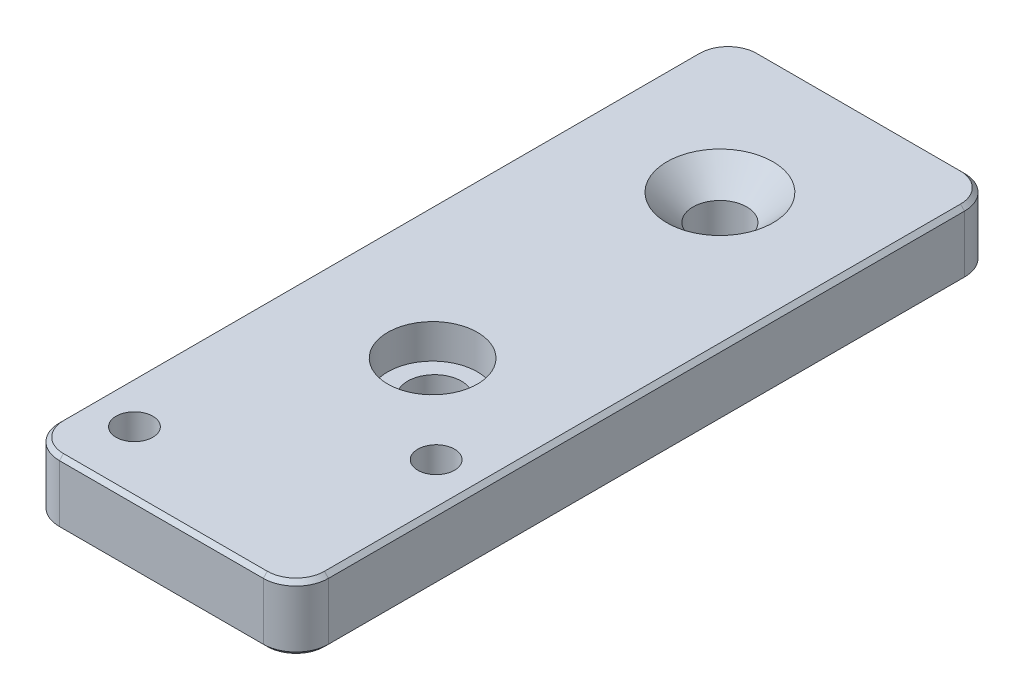
ISO-10303-21;
HEADER;
FILE_DESCRIPTION(('STEP AP214'),'2;1');
FILE_NAME('part.step','',(''),(''),'','','');
FILE_SCHEMA(('AUTOMOTIVE_DESIGN { 1 0 10303 214 1 1 1 1 }'));
ENDSEC;
DATA;
#1=APPLICATION_CONTEXT('core data for automotive mechanical design processes');
#2=APPLICATION_PROTOCOL_DEFINITION('international standard','automotive_design',2000,#1);
#3=PRODUCT_CONTEXT('',#1,'mechanical');
#4=PRODUCT('Part','Part','',(#3));
#5=PRODUCT_RELATED_PRODUCT_CATEGORY('part','',(#4));
#6=PRODUCT_DEFINITION_FORMATION('','',#4);
#7=PRODUCT_DEFINITION_CONTEXT('part definition',#1,'design');
#8=PRODUCT_DEFINITION('design','',#6,#7);
#9=PRODUCT_DEFINITION_SHAPE('','',#8);
#10=(LENGTH_UNIT() NAMED_UNIT(*) SI_UNIT(.MILLI.,.METRE.));
#11=(NAMED_UNIT(*) PLANE_ANGLE_UNIT() SI_UNIT($,.RADIAN.));
#12=(NAMED_UNIT(*) SI_UNIT($,.STERADIAN.) SOLID_ANGLE_UNIT());
#13=UNCERTAINTY_MEASURE_WITH_UNIT(LENGTH_MEASURE(1.E-05),#10,'distance_accuracy_value','');
#14=(GEOMETRIC_REPRESENTATION_CONTEXT(3) GLOBAL_UNCERTAINTY_ASSIGNED_CONTEXT((#13)) GLOBAL_UNIT_ASSIGNED_CONTEXT((#10,
#11,#12)) REPRESENTATION_CONTEXT('',''));
#15=CARTESIAN_POINT('',(0.,0.,0.));
#16=DIRECTION('',(0.,0.,1.));
#17=DIRECTION('',(1.,0.,0.));
#18=AXIS2_PLACEMENT_3D('',#15,#16,#17);
#19=CARTESIAN_POINT('',(11.,8.,20.3));
#20=DIRECTION('',(0.,-1.,0.));
#21=DIRECTION('',(0.,0.,-1.));
#22=AXIS2_PLACEMENT_3D('',#19,#20,#21);
#23=CYLINDRICAL_SURFACE('',#22,2.25);
#24=CARTESIAN_POINT('',(11.,8.,20.3));
#25=DIRECTION('',(0.,1.,0.));
#26=DIRECTION('',(0.,0.,1.));
#27=AXIS2_PLACEMENT_3D('',#24,#25,#26);
#28=CIRCLE('',#27,2.25);
#29=CARTESIAN_POINT('',(11.,8.,22.55));
#30=VERTEX_POINT('',#29);
#31=EDGE_CURVE('E803',#30,#30,#28,.T.);
#32=ORIENTED_EDGE('',*,*,#31,.T.);
#33=EDGE_LOOP('',(#32));
#34=FACE_BOUND('',#33,.T.);
#35=CARTESIAN_POINT('',(11.,4.4,20.3));
#36=DIRECTION('',(0.,-1.,0.));
#37=DIRECTION('',(0.,0.,-1.));
#38=AXIS2_PLACEMENT_3D('',#35,#36,#37);
#39=CIRCLE('',#38,2.25);
#40=CARTESIAN_POINT('',(11.,4.4,18.05));
#41=VERTEX_POINT('',#40);
#42=EDGE_CURVE('E789',#41,#41,#39,.T.);
#43=ORIENTED_EDGE('',*,*,#42,.T.);
#44=EDGE_LOOP('',(#43));
#45=FACE_BOUND('',#44,.T.);
#46=ADVANCED_FACE('F41',(#34,#45),#23,.F.);
#47=CARTESIAN_POINT('',(-11.,8.,35.3));
#48=DIRECTION('',(0.,-1.,0.));
#49=DIRECTION('',(0.,0.,-1.));
#50=AXIS2_PLACEMENT_3D('',#47,#48,#49);
#51=CYLINDRICAL_SURFACE('',#50,2.25);
#52=CARTESIAN_POINT('',(-11.,8.,35.3));
#53=DIRECTION('',(0.,1.,0.));
#54=DIRECTION('',(0.,0.,1.));
#55=AXIS2_PLACEMENT_3D('',#52,#53,#54);
#56=CIRCLE('',#55,2.25);
#57=CARTESIAN_POINT('',(-11.,8.,37.55));
#58=VERTEX_POINT('',#57);
#59=EDGE_CURVE('E799',#58,#58,#56,.T.);
#60=ORIENTED_EDGE('',*,*,#59,.T.);
#61=EDGE_LOOP('',(#60));
#62=FACE_BOUND('',#61,.T.);
#63=CARTESIAN_POINT('',(-11.,4.4,35.3));
#64=DIRECTION('',(0.,-1.,0.));
#65=DIRECTION('',(0.,0.,-1.));
#66=AXIS2_PLACEMENT_3D('',#63,#64,#65);
#67=CIRCLE('',#66,2.25);
#68=CARTESIAN_POINT('',(-11.,4.4,33.05));
#69=VERTEX_POINT('',#68);
#70=EDGE_CURVE('E796',#69,#69,#67,.T.);
#71=ORIENTED_EDGE('',*,*,#70,.T.);
#72=EDGE_LOOP('',(#71));
#73=FACE_BOUND('',#72,.T.);
#74=ADVANCED_FACE('F441',(#62,#73),#51,.F.);
#75=CARTESIAN_POINT('',(0.,8.,9.50000000000003));
#76=DIRECTION('',(0.,-1.,0.));
#77=DIRECTION('',(0.,0.,-1.));
#78=AXIS2_PLACEMENT_3D('',#75,#76,#77);
#79=CYLINDRICAL_SURFACE('',#78,3.3);
#80=CARTESIAN_POINT('',(0.,0.,9.50000000000003));
#81=DIRECTION('',(0.,1.,0.));
#82=DIRECTION('',(0.,0.,1.));
#83=AXIS2_PLACEMENT_3D('',#80,#81,#82);
#84=CIRCLE('',#83,3.3);
#85=CARTESIAN_POINT('',(0.,0.,12.8));
#86=VERTEX_POINT('',#85);
#87=EDGE_CURVE('E806',#86,#86,#84,.T.);
#88=ORIENTED_EDGE('',*,*,#87,.F.);
#89=EDGE_LOOP('',(#88));
#90=FACE_BOUND('',#89,.T.);
#91=CARTESIAN_POINT('',(0.,3.8,9.50000000000003));
#92=DIRECTION('',(0.,1.,0.));
#93=DIRECTION('',(0.,0.,1.));
#94=AXIS2_PLACEMENT_3D('',#91,#92,#93);
#95=CIRCLE('',#94,3.3);
#96=CARTESIAN_POINT('',(0.,3.8,12.8));
#97=VERTEX_POINT('',#96);
#98=EDGE_CURVE('E793',#97,#97,#95,.T.);
#99=ORIENTED_EDGE('',*,*,#98,.T.);
#100=EDGE_LOOP('',(#99));
#101=FACE_BOUND('',#100,.T.);
#102=ADVANCED_FACE('F447',(#90,#101),#79,.F.);
#103=CARTESIAN_POINT('',(0.,8.,0.));
#104=DIRECTION('',(0.,-1.,0.));
#105=DIRECTION('',(0.,0.,-1.));
#106=AXIS2_PLACEMENT_3D('',#103,#104,#105);
#107=PLANE('',#106);
#108=CARTESIAN_POINT('',(-12.5,8.,-39.));
#109=DIRECTION('',(0.,-1.,0.));
#110=DIRECTION('',(0.,0.,-1.));
#111=AXIS2_PLACEMENT_3D('',#108,#109,#110);
#112=CIRCLE('',#111,3.5);
#113=CARTESIAN_POINT('',(-12.5,8.,-42.5));
#114=VERTEX_POINT('',#113);
#115=CARTESIAN_POINT('',(-16.,8.,-39.));
#116=VERTEX_POINT('',#115);
#117=EDGE_CURVE('E377',#114,#116,#112,.F.);
#118=ORIENTED_EDGE('',*,*,#117,.T.);
#119=DIRECTION('',(0.,0.,1.));
#120=VECTOR('',#119,1.);
#121=CARTESIAN_POINT('',(-16.,8.,0.));
#122=LINE('',#121,#120);
#123=CARTESIAN_POINT('',(-16.,8.,39.));
#124=VERTEX_POINT('',#123);
#125=EDGE_CURVE('E380',#116,#124,#122,.T.);
#126=ORIENTED_EDGE('',*,*,#125,.T.);
#127=CARTESIAN_POINT('',(-12.5,8.,39.));
#128=DIRECTION('',(0.,-1.,0.));
#129=DIRECTION('',(0.,0.,-1.));
#130=AXIS2_PLACEMENT_3D('',#127,#128,#129);
#131=CIRCLE('',#130,3.5);
#132=CARTESIAN_POINT('',(-12.5,8.,42.5));
#133=VERTEX_POINT('',#132);
#134=EDGE_CURVE('E163',#124,#133,#131,.F.);
#135=ORIENTED_EDGE('',*,*,#134,.T.);
#136=DIRECTION('',(1.,0.,0.));
#137=VECTOR('',#136,1.);
#138=CARTESIAN_POINT('',(0.,8.,42.5));
#139=LINE('',#138,#137);
#140=CARTESIAN_POINT('',(12.5,8.,42.5));
#141=VERTEX_POINT('',#140);
#142=EDGE_CURVE('E155',#133,#141,#139,.T.);
#143=ORIENTED_EDGE('',*,*,#142,.T.);
#144=CARTESIAN_POINT('',(12.5,8.,39.));
#145=DIRECTION('',(0.,-1.,0.));
#146=DIRECTION('',(0.,0.,-1.));
#147=AXIS2_PLACEMENT_3D('',#144,#145,#146);
#148=CIRCLE('',#147,3.5);
#149=CARTESIAN_POINT('',(16.,8.,39.));
#150=VERTEX_POINT('',#149);
#151=EDGE_CURVE('E159',#141,#150,#148,.F.);
#152=ORIENTED_EDGE('',*,*,#151,.T.);
#153=DIRECTION('',(0.,0.,-1.));
#154=VECTOR('',#153,1.);
#155=CARTESIAN_POINT('',(16.,8.,0.));
#156=LINE('',#155,#154);
#157=CARTESIAN_POINT('',(16.,8.,-39.));
#158=VERTEX_POINT('',#157);
#159=EDGE_CURVE('E368',#150,#158,#156,.T.);
#160=ORIENTED_EDGE('',*,*,#159,.T.);
#161=CARTESIAN_POINT('',(12.5,8.,-39.));
#162=DIRECTION('',(0.,-1.,0.));
#163=DIRECTION('',(0.,0.,-1.));
#164=AXIS2_PLACEMENT_3D('',#161,#162,#163);
#165=CIRCLE('',#164,3.5);
#166=CARTESIAN_POINT('',(12.5,8.,-42.5));
#167=VERTEX_POINT('',#166);
#168=EDGE_CURVE('E371',#158,#167,#165,.F.);
#169=ORIENTED_EDGE('',*,*,#168,.T.);
#170=DIRECTION('',(-1.,0.,0.));
#171=VECTOR('',#170,1.);
#172=CARTESIAN_POINT('',(0.,8.,-42.5));
#173=LINE('',#172,#171);
#174=EDGE_CURVE('E374',#167,#114,#173,.T.);
#175=ORIENTED_EDGE('',*,*,#174,.T.);
#176=EDGE_LOOP('',(#118,#126,#135,#143,#152,#160,#169,#175));
#177=FACE_BOUND('',#176,.T.);
#178=CARTESIAN_POINT('',(0.,8.,-25.5));
#179=DIRECTION('',(0.,-1.,0.));
#180=DIRECTION('',(0.,0.,-1.));
#181=AXIS2_PLACEMENT_3D('',#178,#179,#180);
#182=CIRCLE('',#181,6.49999999999999);
#183=CARTESIAN_POINT('',(0.,8.,-32.));
#184=VERTEX_POINT('',#183);
#185=EDGE_CURVE('E346',#184,#184,#182,.T.);
#186=ORIENTED_EDGE('',*,*,#185,.T.);
#187=EDGE_LOOP('',(#186));
#188=FACE_BOUND('',#187,.T.);
#189=CARTESIAN_POINT('',(0.,8.,9.73630831643001));
#190=DIRECTION('',(0.,1.,0.));
#191=DIRECTION('',(0.,0.,1.));
#192=AXIS2_PLACEMENT_3D('',#189,#190,#191);
#193=CIRCLE('',#192,5.5);
#194=CARTESIAN_POINT('',(0.,8.,15.23630831643));
#195=VERTEX_POINT('',#194);
#196=EDGE_CURVE('E786',#195,#195,#193,.T.);
#197=ORIENTED_EDGE('',*,*,#196,.F.);
#198=EDGE_LOOP('',(#197));
#199=FACE_BOUND('',#198,.T.);
#200=ORIENTED_EDGE('',*,*,#31,.F.);
#201=EDGE_LOOP('',(#200));
#202=FACE_BOUND('',#201,.T.);
#203=ORIENTED_EDGE('',*,*,#59,.F.);
#204=EDGE_LOOP('',(#203));
#205=FACE_BOUND('',#204,.T.);
#206=ADVANCED_FACE('F157',(#177,#188,#199,#202,#205),#107,.F.);
#207=CARTESIAN_POINT('',(0.,0.,0.));
#208=DIRECTION('',(0.,-1.,0.));
#209=DIRECTION('',(0.,0.,-1.));
#210=AXIS2_PLACEMENT_3D('',#207,#208,#209);
#211=PLANE('',#210);
#212=CARTESIAN_POINT('',(12.5,0.,-39.));
#213=DIRECTION('',(0.,-1.,0.));
#214=DIRECTION('',(0.,0.,-1.));
#215=AXIS2_PLACEMENT_3D('',#212,#213,#214);
#216=CIRCLE('',#215,3.5);
#217=CARTESIAN_POINT('',(12.5,0.,-42.5));
#218=VERTEX_POINT('',#217);
#219=CARTESIAN_POINT('',(16.,0.,-39.));
#220=VERTEX_POINT('',#219);
#221=EDGE_CURVE('E52',#218,#220,#216,.T.);
#222=ORIENTED_EDGE('',*,*,#221,.T.);
#223=DIRECTION('',(0.,0.,1.));
#224=VECTOR('',#223,1.);
#225=CARTESIAN_POINT('',(16.,0.,39.));
#226=LINE('',#225,#224);
#227=CARTESIAN_POINT('',(16.,0.,39.));
#228=VERTEX_POINT('',#227);
#229=EDGE_CURVE('E11',#220,#228,#226,.T.);
#230=ORIENTED_EDGE('',*,*,#229,.T.);
#231=CARTESIAN_POINT('',(12.5,0.,39.));
#232=DIRECTION('',(0.,-1.,0.));
#233=DIRECTION('',(0.,0.,-1.));
#234=AXIS2_PLACEMENT_3D('',#231,#232,#233);
#235=CIRCLE('',#234,3.5);
#236=CARTESIAN_POINT('',(12.5,0.,42.5));
#237=VERTEX_POINT('',#236);
#238=EDGE_CURVE('E283',#228,#237,#235,.T.);
#239=ORIENTED_EDGE('',*,*,#238,.T.);
#240=DIRECTION('',(-1.,0.,0.));
#241=VECTOR('',#240,1.);
#242=CARTESIAN_POINT('',(-12.5,0.,42.5));
#243=LINE('',#242,#241);
#244=CARTESIAN_POINT('',(-12.5,0.,42.5));
#245=VERTEX_POINT('',#244);
#246=EDGE_CURVE('E277',#237,#245,#243,.T.);
#247=ORIENTED_EDGE('',*,*,#246,.T.);
#248=CARTESIAN_POINT('',(-12.5,0.,39.));
#249=DIRECTION('',(0.,-1.,0.));
#250=DIRECTION('',(0.,0.,-1.));
#251=AXIS2_PLACEMENT_3D('',#248,#249,#250);
#252=CIRCLE('',#251,3.5);
#253=CARTESIAN_POINT('',(-16.,0.,39.));
#254=VERTEX_POINT('',#253);
#255=EDGE_CURVE('E280',#245,#254,#252,.T.);
#256=ORIENTED_EDGE('',*,*,#255,.T.);
#257=DIRECTION('',(0.,0.,-1.));
#258=VECTOR('',#257,1.);
#259=CARTESIAN_POINT('',(-16.,0.,-39.));
#260=LINE('',#259,#258);
#261=CARTESIAN_POINT('',(-16.,0.,-39.));
#262=VERTEX_POINT('',#261);
#263=EDGE_CURVE('E286',#254,#262,#260,.T.);
#264=ORIENTED_EDGE('',*,*,#263,.T.);
#265=CARTESIAN_POINT('',(-12.5,0.,-39.));
#266=DIRECTION('',(0.,-1.,0.));
#267=DIRECTION('',(0.,0.,-1.));
#268=AXIS2_PLACEMENT_3D('',#265,#266,#267);
#269=CIRCLE('',#268,3.5);
#270=CARTESIAN_POINT('',(-12.5,0.,-42.5));
#271=VERTEX_POINT('',#270);
#272=EDGE_CURVE('E289',#262,#271,#269,.T.);
#273=ORIENTED_EDGE('',*,*,#272,.T.);
#274=DIRECTION('',(1.,0.,0.));
#275=VECTOR('',#274,1.);
#276=CARTESIAN_POINT('',(12.5,0.,-42.5));
#277=LINE('',#276,#275);
#278=EDGE_CURVE('E63',#271,#218,#277,.T.);
#279=ORIENTED_EDGE('',*,*,#278,.T.);
#280=EDGE_LOOP('',(#222,#230,#239,#247,#256,#264,#273,#279));
#281=FACE_BOUND('',#280,.T.);
#282=CARTESIAN_POINT('',(-11.,0.,35.3));
#283=DIRECTION('',(0.,-1.,0.));
#284=DIRECTION('',(0.,0.,-1.));
#285=AXIS2_PLACEMENT_3D('',#282,#283,#284);
#286=CIRCLE('',#285,4.);
#287=CARTESIAN_POINT('',(-11.,0.,31.3));
#288=VERTEX_POINT('',#287);
#289=EDGE_CURVE('E831',#288,#288,#286,.T.);
#290=ORIENTED_EDGE('',*,*,#289,.F.);
#291=EDGE_LOOP('',(#290));
#292=FACE_BOUND('',#291,.T.);
#293=CARTESIAN_POINT('',(11.,0.,20.3));
#294=DIRECTION('',(0.,-1.,0.));
#295=DIRECTION('',(0.,0.,-1.));
#296=AXIS2_PLACEMENT_3D('',#293,#294,#295);
#297=CIRCLE('',#296,4.);
#298=CARTESIAN_POINT('',(11.,0.,16.3));
#299=VERTEX_POINT('',#298);
#300=EDGE_CURVE('E203',#299,#299,#297,.T.);
#301=ORIENTED_EDGE('',*,*,#300,.F.);
#302=EDGE_LOOP('',(#301));
#303=FACE_BOUND('',#302,.T.);
#304=CARTESIAN_POINT('',(0.,0.,-25.5));
#305=DIRECTION('',(0.,1.,0.));
#306=DIRECTION('',(0.,0.,1.));
#307=AXIS2_PLACEMENT_3D('',#304,#305,#306);
#308=CIRCLE('',#307,3.3);
#309=CARTESIAN_POINT('',(0.,0.,-22.2));
#310=VERTEX_POINT('',#309);
#311=EDGE_CURVE('E810',#310,#310,#308,.T.);
#312=ORIENTED_EDGE('',*,*,#311,.T.);
#313=EDGE_LOOP('',(#312));
#314=FACE_BOUND('',#313,.T.);
#315=ORIENTED_EDGE('',*,*,#87,.T.);
#316=EDGE_LOOP('',(#315));
#317=FACE_BOUND('',#316,.T.);
#318=ADVANCED_FACE('F295',(#281,#292,#303,#314,#317),#211,.T.);
#319=CARTESIAN_POINT('',(16.5,8.,43.));
#320=DIRECTION('',(-1.,0.,0.));
#321=DIRECTION('',(0.,0.,1.));
#322=AXIS2_PLACEMENT_3D('',#319,#320,#321);
#323=PLANE('',#322);
#324=DIRECTION('',(0.,-1.,0.));
#325=VECTOR('',#324,1.);
#326=CARTESIAN_POINT('',(16.5,8.,-39.));
#327=LINE('',#326,#325);
#328=CARTESIAN_POINT('',(16.5,0.5,-39.));
#329=VERTEX_POINT('',#328);
#330=CARTESIAN_POINT('',(16.5,7.5,-39.));
#331=VERTEX_POINT('',#330);
#332=EDGE_CURVE('E340',#329,#331,#327,.F.);
#333=ORIENTED_EDGE('',*,*,#332,.T.);
#334=DIRECTION('',(0.,0.,1.));
#335=VECTOR('',#334,1.);
#336=CARTESIAN_POINT('',(16.5,7.5,43.));
#337=LINE('',#336,#335);
#338=CARTESIAN_POINT('',(16.5,7.5,39.));
#339=VERTEX_POINT('',#338);
#340=EDGE_CURVE('E265',#331,#339,#337,.T.);
#341=ORIENTED_EDGE('',*,*,#340,.T.);
#342=DIRECTION('',(0.,-1.,0.));
#343=VECTOR('',#342,1.);
#344=CARTESIAN_POINT('',(16.5,8.,39.));
#345=LINE('',#344,#343);
#346=CARTESIAN_POINT('',(16.5,0.5,39.));
#347=VERTEX_POINT('',#346);
#348=EDGE_CURVE('E330',#339,#347,#345,.T.);
#349=ORIENTED_EDGE('',*,*,#348,.T.);
#350=DIRECTION('',(0.,0.,-1.));
#351=VECTOR('',#350,1.);
#352=CARTESIAN_POINT('',(16.5,0.5,-39.));
#353=LINE('',#352,#351);
#354=EDGE_CURVE('E313',#347,#329,#353,.T.);
#355=ORIENTED_EDGE('',*,*,#354,.T.);
#356=EDGE_LOOP('',(#333,#341,#349,#355));
#357=FACE_BOUND('',#356,.T.);
#358=ADVANCED_FACE('F335',(#357),#323,.F.);
#359=CARTESIAN_POINT('',(-16.5,8.,-43.));
#360=DIRECTION('',(0.,0.,1.));
#361=DIRECTION('',(1.,0.,0.));
#362=AXIS2_PLACEMENT_3D('',#359,#360,#361);
#363=PLANE('',#362);
#364=DIRECTION('',(0.,-1.,0.));
#365=VECTOR('',#364,1.);
#366=CARTESIAN_POINT('',(-12.5,8.,-43.));
#367=LINE('',#366,#365);
#368=CARTESIAN_POINT('',(-12.5,0.5,-43.));
#369=VERTEX_POINT('',#368);
#370=CARTESIAN_POINT('',(-12.5,7.5,-43.));
#371=VERTEX_POINT('',#370);
#372=EDGE_CURVE('E180',#369,#371,#367,.F.);
#373=ORIENTED_EDGE('',*,*,#372,.T.);
#374=DIRECTION('',(1.,0.,0.));
#375=VECTOR('',#374,1.);
#376=CARTESIAN_POINT('',(-16.5,7.5,-43.));
#377=LINE('',#376,#375);
#378=CARTESIAN_POINT('',(12.5,7.5,-43.));
#379=VERTEX_POINT('',#378);
#380=EDGE_CURVE('E397',#371,#379,#377,.T.);
#381=ORIENTED_EDGE('',*,*,#380,.T.);
#382=DIRECTION('',(0.,-1.,0.));
#383=VECTOR('',#382,1.);
#384=CARTESIAN_POINT('',(12.5,8.,-43.));
#385=LINE('',#384,#383);
#386=CARTESIAN_POINT('',(12.5,0.5,-43.));
#387=VERTEX_POINT('',#386);
#388=EDGE_CURVE('E359',#379,#387,#385,.T.);
#389=ORIENTED_EDGE('',*,*,#388,.T.);
#390=DIRECTION('',(-1.,0.,0.));
#391=VECTOR('',#390,1.);
#392=CARTESIAN_POINT('',(-12.5,0.5,-43.));
#393=LINE('',#392,#391);
#394=EDGE_CURVE('E303',#387,#369,#393,.T.);
#395=ORIENTED_EDGE('',*,*,#394,.T.);
#396=EDGE_LOOP('',(#373,#381,#389,#395));
#397=FACE_BOUND('',#396,.T.);
#398=ADVANCED_FACE('F473',(#397),#363,.F.);
#399=CARTESIAN_POINT('',(-16.5,8.,43.));
#400=DIRECTION('',(1.,0.,0.));
#401=DIRECTION('',(0.,0.,-1.));
#402=AXIS2_PLACEMENT_3D('',#399,#400,#401);
#403=PLANE('',#402);
#404=DIRECTION('',(0.,-1.,0.));
#405=VECTOR('',#404,1.);
#406=CARTESIAN_POINT('',(-16.5,8.,39.));
#407=LINE('',#406,#405);
#408=CARTESIAN_POINT('',(-16.5,0.5,39.));
#409=VERTEX_POINT('',#408);
#410=CARTESIAN_POINT('',(-16.5,7.5,39.));
#411=VERTEX_POINT('',#410);
#412=EDGE_CURVE('E356',#409,#411,#407,.F.);
#413=ORIENTED_EDGE('',*,*,#412,.T.);
#414=DIRECTION('',(0.,0.,-1.));
#415=VECTOR('',#414,1.);
#416=CARTESIAN_POINT('',(-16.5,7.5,43.));
#417=LINE('',#416,#415);
#418=CARTESIAN_POINT('',(-16.5,7.5,-39.));
#419=VERTEX_POINT('',#418);
#420=EDGE_CURVE('E386',#411,#419,#417,.T.);
#421=ORIENTED_EDGE('',*,*,#420,.T.);
#422=DIRECTION('',(0.,-1.,0.));
#423=VECTOR('',#422,1.);
#424=CARTESIAN_POINT('',(-16.5,8.,-39.));
#425=LINE('',#424,#423);
#426=CARTESIAN_POINT('',(-16.5,0.5,-39.));
#427=VERTEX_POINT('',#426);
#428=EDGE_CURVE('E352',#419,#427,#425,.T.);
#429=ORIENTED_EDGE('',*,*,#428,.T.);
#430=DIRECTION('',(0.,0.,1.));
#431=VECTOR('',#430,1.);
#432=CARTESIAN_POINT('',(-16.5,0.5,39.));
#433=LINE('',#432,#431);
#434=EDGE_CURVE('E383',#427,#409,#433,.T.);
#435=ORIENTED_EDGE('',*,*,#434,.T.);
#436=EDGE_LOOP('',(#413,#421,#429,#435));
#437=FACE_BOUND('',#436,.T.);
#438=ADVANCED_FACE('F469',(#437),#403,.F.);
#439=CARTESIAN_POINT('',(-16.5,8.,43.));
#440=DIRECTION('',(0.,0.,-1.));
#441=DIRECTION('',(-1.,0.,0.));
#442=AXIS2_PLACEMENT_3D('',#439,#440,#441);
#443=PLANE('',#442);
#444=DIRECTION('',(0.,-1.,0.));
#445=VECTOR('',#444,1.);
#446=CARTESIAN_POINT('',(12.5,8.,43.));
#447=LINE('',#446,#445);
#448=CARTESIAN_POINT('',(12.5,0.5,43.));
#449=VERTEX_POINT('',#448);
#450=CARTESIAN_POINT('',(12.5,7.5,43.));
#451=VERTEX_POINT('',#450);
#452=EDGE_CURVE('E332',#449,#451,#447,.F.);
#453=ORIENTED_EDGE('',*,*,#452,.T.);
#454=DIRECTION('',(-1.,0.,0.));
#455=VECTOR('',#454,1.);
#456=CARTESIAN_POINT('',(-16.5,7.5,43.));
#457=LINE('',#456,#455);
#458=CARTESIAN_POINT('',(-12.5,7.5,43.));
#459=VERTEX_POINT('',#458);
#460=EDGE_CURVE('E183',#451,#459,#457,.T.);
#461=ORIENTED_EDGE('',*,*,#460,.T.);
#462=DIRECTION('',(0.,-1.,0.));
#463=VECTOR('',#462,1.);
#464=CARTESIAN_POINT('',(-12.5,8.,43.));
#465=LINE('',#464,#463);
#466=CARTESIAN_POINT('',(-12.5,0.5,43.));
#467=VERTEX_POINT('',#466);
#468=EDGE_CURVE('E339',#459,#467,#465,.T.);
#469=ORIENTED_EDGE('',*,*,#468,.T.);
#470=DIRECTION('',(1.,0.,0.));
#471=VECTOR('',#470,1.);
#472=CARTESIAN_POINT('',(12.5,0.5,43.));
#473=LINE('',#472,#471);
#474=EDGE_CURVE('E259',#467,#449,#473,.T.);
#475=ORIENTED_EDGE('',*,*,#474,.T.);
#476=EDGE_LOOP('',(#453,#461,#469,#475));
#477=FACE_BOUND('',#476,.T.);
#478=ADVANCED_FACE('F461',(#477),#443,.F.);
#479=CARTESIAN_POINT('',(0.,8.,-25.5));
#480=DIRECTION('',(0.,-1.,0.));
#481=DIRECTION('',(0.,0.,-1.));
#482=AXIS2_PLACEMENT_3D('',#479,#480,#481);
#483=CYLINDRICAL_SURFACE('',#482,3.3);
#484=CARTESIAN_POINT('',(0.,4.80000000000003,-25.5));
#485=DIRECTION('',(0.,-1.,0.));
#486=DIRECTION('',(0.,0.,-1.));
#487=AXIS2_PLACEMENT_3D('',#484,#485,#486);
#488=CIRCLE('',#487,3.3);
#489=CARTESIAN_POINT('',(0.,4.80000000000003,-28.8));
#490=VERTEX_POINT('',#489);
#491=EDGE_CURVE('E814',#490,#490,#488,.F.);
#492=ORIENTED_EDGE('',*,*,#491,.T.);
#493=EDGE_LOOP('',(#492));
#494=FACE_BOUND('',#493,.T.);
#495=ORIENTED_EDGE('',*,*,#311,.F.);
#496=EDGE_LOOP('',(#495));
#497=FACE_BOUND('',#496,.T.);
#498=ADVANCED_FACE('F457',(#494,#497),#483,.F.);
#499=CARTESIAN_POINT('',(0.,3.8,9.73630831643001));
#500=DIRECTION('',(0.,1.,0.));
#501=DIRECTION('',(0.,0.,1.));
#502=AXIS2_PLACEMENT_3D('',#499,#500,#501);
#503=CYLINDRICAL_SURFACE('',#502,5.5);
#504=CARTESIAN_POINT('',(0.,3.8,9.73630831643001));
#505=DIRECTION('',(0.,1.,0.));
#506=DIRECTION('',(0.,0.,1.));
#507=AXIS2_PLACEMENT_3D('',#504,#505,#506);
#508=CIRCLE('',#507,5.5);
#509=CARTESIAN_POINT('',(0.,3.8,15.23630831643));
#510=VERTEX_POINT('',#509);
#511=EDGE_CURVE('E783',#510,#510,#508,.T.);
#512=ORIENTED_EDGE('',*,*,#511,.F.);
#513=EDGE_LOOP('',(#512));
#514=FACE_BOUND('',#513,.T.);
#515=ORIENTED_EDGE('',*,*,#196,.T.);
#516=EDGE_LOOP('',(#515));
#517=FACE_BOUND('',#516,.T.);
#518=ADVANCED_FACE('F460',(#514,#517),#503,.F.);
#519=CARTESIAN_POINT('',(0.,3.8,9.73630831643001));
#520=DIRECTION('',(0.,1.,0.));
#521=DIRECTION('',(0.,0.,1.));
#522=AXIS2_PLACEMENT_3D('',#519,#520,#521);
#523=PLANE('',#522);
#524=ORIENTED_EDGE('',*,*,#98,.F.);
#525=EDGE_LOOP('',(#524));
#526=FACE_BOUND('',#525,.T.);
#527=ORIENTED_EDGE('',*,*,#511,.T.);
#528=EDGE_LOOP('',(#527));
#529=FACE_BOUND('',#528,.T.);
#530=ADVANCED_FACE('F488',(#526,#529),#523,.T.);
#531=CARTESIAN_POINT('',(0.,4.80000000000003,-25.5));
#532=DIRECTION('',(0.,1.,0.));
#533=DIRECTION('',(0.,0.,1.));
#534=AXIS2_PLACEMENT_3D('',#531,#532,#533);
#535=CONICAL_SURFACE('',#534,3.3,0.785398163397451);
#536=ORIENTED_EDGE('',*,*,#185,.F.);
#537=EDGE_LOOP('',(#536));
#538=FACE_BOUND('',#537,.T.);
#539=ORIENTED_EDGE('',*,*,#491,.F.);
#540=EDGE_LOOP('',(#539));
#541=FACE_BOUND('',#540,.T.);
#542=ADVANCED_FACE('F481',(#538,#541),#535,.F.);
#543=CARTESIAN_POINT('',(-11.,4.4,35.3));
#544=DIRECTION('',(0.,-1.,0.));
#545=DIRECTION('',(0.,0.,-1.));
#546=AXIS2_PLACEMENT_3D('',#543,#544,#545);
#547=CYLINDRICAL_SURFACE('',#546,4.);
#548=CARTESIAN_POINT('',(-11.,4.4,35.3));
#549=DIRECTION('',(0.,-1.,0.));
#550=DIRECTION('',(0.,0.,-1.));
#551=AXIS2_PLACEMENT_3D('',#548,#549,#550);
#552=CIRCLE('',#551,4.);
#553=CARTESIAN_POINT('',(-11.,4.4,31.3));
#554=VERTEX_POINT('',#553);
#555=EDGE_CURVE('E826',#554,#554,#552,.T.);
#556=ORIENTED_EDGE('',*,*,#555,.F.);
#557=EDGE_LOOP('',(#556));
#558=FACE_BOUND('',#557,.T.);
#559=ORIENTED_EDGE('',*,*,#289,.T.);
#560=EDGE_LOOP('',(#559));
#561=FACE_BOUND('',#560,.T.);
#562=ADVANCED_FACE('F487',(#558,#561),#547,.F.);
#563=CARTESIAN_POINT('',(-11.,4.4,35.3));
#564=DIRECTION('',(0.,-1.,0.));
#565=DIRECTION('',(0.,0.,-1.));
#566=AXIS2_PLACEMENT_3D('',#563,#564,#565);
#567=PLANE('',#566);
#568=ORIENTED_EDGE('',*,*,#70,.F.);
#569=EDGE_LOOP('',(#568));
#570=FACE_BOUND('',#569,.T.);
#571=ORIENTED_EDGE('',*,*,#555,.T.);
#572=EDGE_LOOP('',(#571));
#573=FACE_BOUND('',#572,.T.);
#574=ADVANCED_FACE('F675',(#570,#573),#567,.T.);
#575=CARTESIAN_POINT('',(11.,4.4,20.3));
#576=DIRECTION('',(0.,-1.,0.));
#577=DIRECTION('',(0.,0.,-1.));
#578=AXIS2_PLACEMENT_3D('',#575,#576,#577);
#579=CYLINDRICAL_SURFACE('',#578,4.);
#580=CARTESIAN_POINT('',(11.,4.4,20.3));
#581=DIRECTION('',(0.,-1.,0.));
#582=DIRECTION('',(0.,0.,-1.));
#583=AXIS2_PLACEMENT_3D('',#580,#581,#582);
#584=CIRCLE('',#583,4.);
#585=CARTESIAN_POINT('',(11.,4.4,16.3));
#586=VERTEX_POINT('',#585);
#587=EDGE_CURVE('E837',#586,#586,#584,.T.);
#588=ORIENTED_EDGE('',*,*,#587,.F.);
#589=EDGE_LOOP('',(#588));
#590=FACE_BOUND('',#589,.T.);
#591=ORIENTED_EDGE('',*,*,#300,.T.);
#592=EDGE_LOOP('',(#591));
#593=FACE_BOUND('',#592,.T.);
#594=ADVANCED_FACE('F665',(#590,#593),#579,.F.);
#595=CARTESIAN_POINT('',(11.,4.4,20.3));
#596=DIRECTION('',(0.,-1.,0.));
#597=DIRECTION('',(0.,0.,-1.));
#598=AXIS2_PLACEMENT_3D('',#595,#596,#597);
#599=PLANE('',#598);
#600=ORIENTED_EDGE('',*,*,#42,.F.);
#601=EDGE_LOOP('',(#600));
#602=FACE_BOUND('',#601,.T.);
#603=ORIENTED_EDGE('',*,*,#587,.T.);
#604=EDGE_LOOP('',(#603));
#605=FACE_BOUND('',#604,.T.);
#606=ADVANCED_FACE('F493',(#602,#605),#599,.T.);
#607=CARTESIAN_POINT('',(12.5,8.,39.));
#608=DIRECTION('',(0.,-1.,0.));
#609=DIRECTION('',(0.,0.,-1.));
#610=AXIS2_PLACEMENT_3D('',#607,#608,#609);
#611=CYLINDRICAL_SURFACE('',#610,4.);
#612=ORIENTED_EDGE('',*,*,#348,.F.);
#613=CARTESIAN_POINT('',(12.5,7.5,39.));
#614=DIRECTION('',(0.,-1.,0.));
#615=DIRECTION('',(0.,0.,-1.));
#616=AXIS2_PLACEMENT_3D('',#613,#614,#615);
#617=CIRCLE('',#616,4.);
#618=EDGE_CURVE('E274',#339,#451,#617,.T.);
#619=ORIENTED_EDGE('',*,*,#618,.T.);
#620=ORIENTED_EDGE('',*,*,#452,.F.);
#621=CARTESIAN_POINT('',(12.5,0.5,39.));
#622=DIRECTION('',(0.,-1.,0.));
#623=DIRECTION('',(0.,0.,-1.));
#624=AXIS2_PLACEMENT_3D('',#621,#622,#623);
#625=CIRCLE('',#624,4.);
#626=EDGE_CURVE('E271',#449,#347,#625,.F.);
#627=ORIENTED_EDGE('',*,*,#626,.T.);
#628=EDGE_LOOP('',(#612,#619,#620,#627));
#629=FACE_BOUND('',#628,.T.);
#630=ADVANCED_FACE('F329',(#629),#611,.T.);
#631=CARTESIAN_POINT('',(-12.5,8.,39.));
#632=DIRECTION('',(0.,-1.,0.));
#633=DIRECTION('',(0.,0.,-1.));
#634=AXIS2_PLACEMENT_3D('',#631,#632,#633);
#635=CYLINDRICAL_SURFACE('',#634,4.);
#636=ORIENTED_EDGE('',*,*,#468,.F.);
#637=CARTESIAN_POINT('',(-12.5,7.5,39.));
#638=DIRECTION('',(0.,-1.,0.));
#639=DIRECTION('',(0.,0.,-1.));
#640=AXIS2_PLACEMENT_3D('',#637,#638,#639);
#641=CIRCLE('',#640,4.);
#642=EDGE_CURVE('E253',#459,#411,#641,.T.);
#643=ORIENTED_EDGE('',*,*,#642,.T.);
#644=ORIENTED_EDGE('',*,*,#412,.F.);
#645=CARTESIAN_POINT('',(-12.5,0.5,39.));
#646=DIRECTION('',(0.,-1.,0.));
#647=DIRECTION('',(0.,0.,-1.));
#648=AXIS2_PLACEMENT_3D('',#645,#646,#647);
#649=CIRCLE('',#648,4.);
#650=EDGE_CURVE('E260',#409,#467,#649,.F.);
#651=ORIENTED_EDGE('',*,*,#650,.T.);
#652=EDGE_LOOP('',(#636,#643,#644,#651));
#653=FACE_BOUND('',#652,.T.);
#654=ADVANCED_FACE('F492',(#653),#635,.T.);
#655=CARTESIAN_POINT('',(-12.5,8.,-39.));
#656=DIRECTION('',(0.,-1.,0.));
#657=DIRECTION('',(0.,0.,-1.));
#658=AXIS2_PLACEMENT_3D('',#655,#656,#657);
#659=CYLINDRICAL_SURFACE('',#658,4.);
#660=ORIENTED_EDGE('',*,*,#428,.F.);
#661=CARTESIAN_POINT('',(-12.5,7.5,-39.));
#662=DIRECTION('',(0.,-1.,0.));
#663=DIRECTION('',(0.,0.,-1.));
#664=AXIS2_PLACEMENT_3D('',#661,#662,#663);
#665=CIRCLE('',#664,4.);
#666=EDGE_CURVE('E392',#419,#371,#665,.T.);
#667=ORIENTED_EDGE('',*,*,#666,.T.);
#668=ORIENTED_EDGE('',*,*,#372,.F.);
#669=CARTESIAN_POINT('',(-12.5,0.5,-39.));
#670=DIRECTION('',(0.,-1.,0.));
#671=DIRECTION('',(0.,0.,-1.));
#672=AXIS2_PLACEMENT_3D('',#669,#670,#671);
#673=CIRCLE('',#672,4.);
#674=EDGE_CURVE('E299',#369,#427,#673,.F.);
#675=ORIENTED_EDGE('',*,*,#674,.T.);
#676=EDGE_LOOP('',(#660,#667,#668,#675));
#677=FACE_BOUND('',#676,.T.);
#678=ADVANCED_FACE('F496',(#677),#659,.T.);
#679=CARTESIAN_POINT('',(12.5,8.,-39.));
#680=DIRECTION('',(0.,-1.,0.));
#681=DIRECTION('',(0.,0.,-1.));
#682=AXIS2_PLACEMENT_3D('',#679,#680,#681);
#683=CYLINDRICAL_SURFACE('',#682,4.);
#684=ORIENTED_EDGE('',*,*,#388,.F.);
#685=CARTESIAN_POINT('',(12.5,7.5,-39.));
#686=DIRECTION('',(0.,-1.,0.));
#687=DIRECTION('',(0.,0.,-1.));
#688=AXIS2_PLACEMENT_3D('',#685,#686,#687);
#689=CIRCLE('',#688,4.);
#690=EDGE_CURVE('E402',#379,#331,#689,.T.);
#691=ORIENTED_EDGE('',*,*,#690,.T.);
#692=ORIENTED_EDGE('',*,*,#332,.F.);
#693=CARTESIAN_POINT('',(12.5,0.5,-39.));
#694=DIRECTION('',(0.,-1.,0.));
#695=DIRECTION('',(0.,0.,-1.));
#696=AXIS2_PLACEMENT_3D('',#693,#694,#695);
#697=CIRCLE('',#696,4.);
#698=EDGE_CURVE('E308',#329,#387,#697,.F.);
#699=ORIENTED_EDGE('',*,*,#698,.T.);
#700=EDGE_LOOP('',(#684,#691,#692,#699));
#701=FACE_BOUND('',#700,.T.);
#702=ADVANCED_FACE('F410',(#701),#683,.T.);
#703=CARTESIAN_POINT('',(16.,8.,0.));
#704=DIRECTION('',(-0.707106781186545,-0.70710678118655,0.));
#705=DIRECTION('',(0.,0.,-1.));
#706=AXIS2_PLACEMENT_3D('',#703,#704,#705);
#707=PLANE('',#706);
#708=DIRECTION('',(-0.70710678118655,0.707106781186545,0.));
#709=VECTOR('',#708,1.);
#710=CARTESIAN_POINT('',(16.5,7.5,39.));
#711=LINE('',#710,#709);
#712=EDGE_CURVE('E178',#339,#150,#711,.T.);
#713=ORIENTED_EDGE('',*,*,#712,.F.);
#714=ORIENTED_EDGE('',*,*,#340,.F.);
#715=DIRECTION('',(0.70710678118655,-0.707106781186545,0.));
#716=VECTOR('',#715,1.);
#717=CARTESIAN_POINT('',(16.,8.,-39.));
#718=LINE('',#717,#716);
#719=EDGE_CURVE('E199',#158,#331,#718,.T.);
#720=ORIENTED_EDGE('',*,*,#719,.F.);
#721=ORIENTED_EDGE('',*,*,#159,.F.);
#722=EDGE_LOOP('',(#713,#714,#720,#721));
#723=FACE_BOUND('',#722,.T.);
#724=ADVANCED_FACE('F415',(#723),#707,.F.);
#725=CARTESIAN_POINT('',(12.5,8.,-39.));
#726=DIRECTION('',(0.,-1.,0.));
#727=DIRECTION('',(0.,0.,-1.));
#728=AXIS2_PLACEMENT_3D('',#725,#726,#727);
#729=CONICAL_SURFACE('',#728,3.5,0.785398163397455);
#730=ORIENTED_EDGE('',*,*,#719,.T.);
#731=ORIENTED_EDGE('',*,*,#690,.F.);
#732=DIRECTION('',(0.,-0.707106781186545,-0.70710678118655));
#733=VECTOR('',#732,1.);
#734=CARTESIAN_POINT('',(12.5,8.,-42.5));
#735=LINE('',#734,#733);
#736=EDGE_CURVE('E185',#167,#379,#735,.T.);
#737=ORIENTED_EDGE('',*,*,#736,.F.);
#738=ORIENTED_EDGE('',*,*,#168,.F.);
#739=EDGE_LOOP('',(#730,#731,#737,#738));
#740=FACE_BOUND('',#739,.T.);
#741=ADVANCED_FACE('F417',(#740),#729,.T.);
#742=CARTESIAN_POINT('',(12.5,8.,39.));
#743=DIRECTION('',(0.,-1.,0.));
#744=DIRECTION('',(0.,0.,-1.));
#745=AXIS2_PLACEMENT_3D('',#742,#743,#744);
#746=CONICAL_SURFACE('',#745,3.5,0.785398163397452);
#747=ORIENTED_EDGE('',*,*,#712,.T.);
#748=ORIENTED_EDGE('',*,*,#151,.F.);
#749=DIRECTION('',(0.,0.707106781186545,-0.70710678118655));
#750=VECTOR('',#749,1.);
#751=CARTESIAN_POINT('',(12.5,7.5,43.));
#752=LINE('',#751,#750);
#753=EDGE_CURVE('E175',#451,#141,#752,.T.);
#754=ORIENTED_EDGE('',*,*,#753,.F.);
#755=ORIENTED_EDGE('',*,*,#618,.F.);
#756=EDGE_LOOP('',(#747,#748,#754,#755));
#757=FACE_BOUND('',#756,.T.);
#758=ADVANCED_FACE('F173',(#757),#746,.T.);
#759=CARTESIAN_POINT('',(0.,8.,-42.5));
#760=DIRECTION('',(0.,-0.70710678118655,0.707106781186545));
#761=DIRECTION('',(-1.,0.,0.));
#762=AXIS2_PLACEMENT_3D('',#759,#760,#761);
#763=PLANE('',#762);
#764=ORIENTED_EDGE('',*,*,#736,.T.);
#765=ORIENTED_EDGE('',*,*,#380,.F.);
#766=DIRECTION('',(0.,-0.707106781186545,-0.70710678118655));
#767=VECTOR('',#766,1.);
#768=CARTESIAN_POINT('',(-12.5,8.,-42.5));
#769=LINE('',#768,#767);
#770=EDGE_CURVE('E186',#114,#371,#769,.T.);
#771=ORIENTED_EDGE('',*,*,#770,.F.);
#772=ORIENTED_EDGE('',*,*,#174,.F.);
#773=EDGE_LOOP('',(#764,#765,#771,#772));
#774=FACE_BOUND('',#773,.T.);
#775=ADVANCED_FACE('F424',(#774),#763,.F.);
#776=CARTESIAN_POINT('',(0.,8.,42.5));
#777=DIRECTION('',(0.,-0.70710678118655,-0.707106781186545));
#778=DIRECTION('',(1.,0.,0.));
#779=AXIS2_PLACEMENT_3D('',#776,#777,#778);
#780=PLANE('',#779);
#781=ORIENTED_EDGE('',*,*,#753,.T.);
#782=ORIENTED_EDGE('',*,*,#142,.F.);
#783=DIRECTION('',(0.,0.707106781186545,-0.70710678118655));
#784=VECTOR('',#783,1.);
#785=CARTESIAN_POINT('',(-12.5,7.5,43.));
#786=LINE('',#785,#784);
#787=EDGE_CURVE('E193',#459,#133,#786,.T.);
#788=ORIENTED_EDGE('',*,*,#787,.F.);
#789=ORIENTED_EDGE('',*,*,#460,.F.);
#790=EDGE_LOOP('',(#781,#782,#788,#789));
#791=FACE_BOUND('',#790,.T.);
#792=ADVANCED_FACE('F182',(#791),#780,.F.);
#793=CARTESIAN_POINT('',(-12.5,8.,-39.));
#794=DIRECTION('',(0.,-1.,0.));
#795=DIRECTION('',(0.,0.,-1.));
#796=AXIS2_PLACEMENT_3D('',#793,#794,#795);
#797=CONICAL_SURFACE('',#796,3.5,0.785398163397452);
#798=ORIENTED_EDGE('',*,*,#770,.T.);
#799=ORIENTED_EDGE('',*,*,#666,.F.);
#800=DIRECTION('',(-0.70710678118655,-0.707106781186545,0.));
#801=VECTOR('',#800,1.);
#802=CARTESIAN_POINT('',(-16.,8.,-39.));
#803=LINE('',#802,#801);
#804=EDGE_CURVE('E240',#116,#419,#803,.T.);
#805=ORIENTED_EDGE('',*,*,#804,.F.);
#806=ORIENTED_EDGE('',*,*,#117,.F.);
#807=EDGE_LOOP('',(#798,#799,#805,#806));
#808=FACE_BOUND('',#807,.T.);
#809=ADVANCED_FACE('F427',(#808),#797,.T.);
#810=CARTESIAN_POINT('',(-12.5,8.,39.));
#811=DIRECTION('',(0.,-1.,0.));
#812=DIRECTION('',(0.,0.,-1.));
#813=AXIS2_PLACEMENT_3D('',#810,#811,#812);
#814=CONICAL_SURFACE('',#813,3.5,0.785398163397455);
#815=ORIENTED_EDGE('',*,*,#787,.T.);
#816=ORIENTED_EDGE('',*,*,#134,.F.);
#817=DIRECTION('',(0.707106781186552,0.707106781186543,0.));
#818=VECTOR('',#817,1.);
#819=CARTESIAN_POINT('',(-16.5,7.5,39.));
#820=LINE('',#819,#818);
#821=EDGE_CURVE('E234',#411,#124,#820,.T.);
#822=ORIENTED_EDGE('',*,*,#821,.F.);
#823=ORIENTED_EDGE('',*,*,#642,.F.);
#824=EDGE_LOOP('',(#815,#816,#822,#823));
#825=FACE_BOUND('',#824,.T.);
#826=ADVANCED_FACE('F252',(#825),#814,.T.);
#827=CARTESIAN_POINT('',(-16.,8.,0.));
#828=DIRECTION('',(0.707106781186545,-0.70710678118655,0.));
#829=DIRECTION('',(0.,0.,1.));
#830=AXIS2_PLACEMENT_3D('',#827,#828,#829);
#831=PLANE('',#830);
#832=ORIENTED_EDGE('',*,*,#804,.T.);
#833=ORIENTED_EDGE('',*,*,#420,.F.);
#834=ORIENTED_EDGE('',*,*,#821,.T.);
#835=ORIENTED_EDGE('',*,*,#125,.F.);
#836=EDGE_LOOP('',(#832,#833,#834,#835));
#837=FACE_BOUND('',#836,.T.);
#838=ADVANCED_FACE('F428',(#837),#831,.F.);
#839=CARTESIAN_POINT('',(-16.5,0.5,43.));
#840=DIRECTION('',(-0.707106781186547,-0.707106781186547,0.));
#841=DIRECTION('',(0.,0.,-1.));
#842=AXIS2_PLACEMENT_3D('',#839,#840,#841);
#843=PLANE('',#842);
#844=DIRECTION('',(-0.707106781186547,0.707106781186547,0.));
#845=VECTOR('',#844,1.);
#846=CARTESIAN_POINT('',(-16.,0.,-39.));
#847=LINE('',#846,#845);
#848=EDGE_CURVE('E225',#262,#427,#847,.T.);
#849=ORIENTED_EDGE('',*,*,#848,.F.);
#850=ORIENTED_EDGE('',*,*,#263,.F.);
#851=DIRECTION('',(0.707106781186547,-0.707106781186547,0.));
#852=VECTOR('',#851,1.);
#853=CARTESIAN_POINT('',(-16.5,0.5,39.));
#854=LINE('',#853,#852);
#855=EDGE_CURVE('E46',#409,#254,#854,.T.);
#856=ORIENTED_EDGE('',*,*,#855,.F.);
#857=ORIENTED_EDGE('',*,*,#434,.F.);
#858=EDGE_LOOP('',(#849,#850,#856,#857));
#859=FACE_BOUND('',#858,.T.);
#860=ADVANCED_FACE('F44',(#859),#843,.T.);
#861=CARTESIAN_POINT('',(-12.5,0.,39.));
#862=DIRECTION('',(0.,1.,0.));
#863=DIRECTION('',(0.,0.,1.));
#864=AXIS2_PLACEMENT_3D('',#861,#862,#863);
#865=CONICAL_SURFACE('',#864,3.5,0.785398163397452);
#866=ORIENTED_EDGE('',*,*,#855,.T.);
#867=ORIENTED_EDGE('',*,*,#255,.F.);
#868=DIRECTION('',(0.,-0.707106781186547,-0.707106781186547));
#869=VECTOR('',#868,1.);
#870=CARTESIAN_POINT('',(-12.5,0.5,43.));
#871=LINE('',#870,#869);
#872=EDGE_CURVE('E222',#467,#245,#871,.T.);
#873=ORIENTED_EDGE('',*,*,#872,.F.);
#874=ORIENTED_EDGE('',*,*,#650,.F.);
#875=EDGE_LOOP('',(#866,#867,#873,#874));
#876=FACE_BOUND('',#875,.T.);
#877=ADVANCED_FACE('F435',(#876),#865,.T.);
#878=CARTESIAN_POINT('',(-12.5,0.,-39.));
#879=DIRECTION('',(0.,1.,0.));
#880=DIRECTION('',(0.,0.,1.));
#881=AXIS2_PLACEMENT_3D('',#878,#879,#880);
#882=CONICAL_SURFACE('',#881,3.5,0.785398163397448);
#883=ORIENTED_EDGE('',*,*,#848,.T.);
#884=ORIENTED_EDGE('',*,*,#674,.F.);
#885=DIRECTION('',(0.,0.707106781186547,-0.707106781186547));
#886=VECTOR('',#885,1.);
#887=CARTESIAN_POINT('',(-12.5,0.,-42.5));
#888=LINE('',#887,#886);
#889=EDGE_CURVE('E218',#271,#369,#888,.T.);
#890=ORIENTED_EDGE('',*,*,#889,.F.);
#891=ORIENTED_EDGE('',*,*,#272,.F.);
#892=EDGE_LOOP('',(#883,#884,#890,#891));
#893=FACE_BOUND('',#892,.T.);
#894=ADVANCED_FACE('F298',(#893),#882,.T.);
#895=CARTESIAN_POINT('',(-16.5,0.5,43.));
#896=DIRECTION('',(0.,-0.707106781186547,0.707106781186547));
#897=DIRECTION('',(-1.,0.,0.));
#898=AXIS2_PLACEMENT_3D('',#895,#896,#897);
#899=PLANE('',#898);
#900=ORIENTED_EDGE('',*,*,#872,.T.);
#901=ORIENTED_EDGE('',*,*,#246,.F.);
#902=DIRECTION('',(0.,-0.707106781186547,-0.707106781186547));
#903=VECTOR('',#902,1.);
#904=CARTESIAN_POINT('',(12.5,0.5,43.));
#905=LINE('',#904,#903);
#906=EDGE_CURVE('E214',#449,#237,#905,.T.);
#907=ORIENTED_EDGE('',*,*,#906,.F.);
#908=ORIENTED_EDGE('',*,*,#474,.F.);
#909=EDGE_LOOP('',(#900,#901,#907,#908));
#910=FACE_BOUND('',#909,.T.);
#911=ADVANCED_FACE('F320',(#910),#899,.T.);
#912=CARTESIAN_POINT('',(-16.5,0.5,-43.));
#913=DIRECTION('',(0.,-0.707106781186547,-0.707106781186547));
#914=DIRECTION('',(1.,0.,0.));
#915=AXIS2_PLACEMENT_3D('',#912,#913,#914);
#916=PLANE('',#915);
#917=ORIENTED_EDGE('',*,*,#889,.T.);
#918=ORIENTED_EDGE('',*,*,#394,.F.);
#919=DIRECTION('',(0.,0.707106781186547,-0.707106781186547));
#920=VECTOR('',#919,1.);
#921=CARTESIAN_POINT('',(12.5,0.,-42.5));
#922=LINE('',#921,#920);
#923=EDGE_CURVE('E210',#218,#387,#922,.T.);
#924=ORIENTED_EDGE('',*,*,#923,.F.);
#925=ORIENTED_EDGE('',*,*,#278,.F.);
#926=EDGE_LOOP('',(#917,#918,#924,#925));
#927=FACE_BOUND('',#926,.T.);
#928=ADVANCED_FACE('F302',(#927),#916,.T.);
#929=CARTESIAN_POINT('',(12.5,0.,39.));
#930=DIRECTION('',(0.,1.,0.));
#931=DIRECTION('',(0.,0.,1.));
#932=AXIS2_PLACEMENT_3D('',#929,#930,#931);
#933=CONICAL_SURFACE('',#932,3.5,0.785398163397448);
#934=ORIENTED_EDGE('',*,*,#906,.T.);
#935=ORIENTED_EDGE('',*,*,#238,.F.);
#936=DIRECTION('',(-0.70710678118655,-0.707106781186545,0.));
#937=VECTOR('',#936,1.);
#938=CARTESIAN_POINT('',(16.5,0.5,39.));
#939=LINE('',#938,#937);
#940=EDGE_CURVE('E207',#347,#228,#939,.T.);
#941=ORIENTED_EDGE('',*,*,#940,.F.);
#942=ORIENTED_EDGE('',*,*,#626,.F.);
#943=EDGE_LOOP('',(#934,#935,#941,#942));
#944=FACE_BOUND('',#943,.T.);
#945=ADVANCED_FACE('F324',(#944),#933,.T.);
#946=CARTESIAN_POINT('',(12.5,0.,-39.));
#947=DIRECTION('',(0.,1.,0.));
#948=DIRECTION('',(0.,0.,1.));
#949=AXIS2_PLACEMENT_3D('',#946,#947,#948);
#950=CONICAL_SURFACE('',#949,3.5,0.785398163397452);
#951=ORIENTED_EDGE('',*,*,#923,.T.);
#952=ORIENTED_EDGE('',*,*,#698,.F.);
#953=DIRECTION('',(0.70710678118655,0.707106781186545,0.));
#954=VECTOR('',#953,1.);
#955=CARTESIAN_POINT('',(16.,0.,-39.));
#956=LINE('',#955,#954);
#957=EDGE_CURVE('E204',#220,#329,#956,.T.);
#958=ORIENTED_EDGE('',*,*,#957,.F.);
#959=ORIENTED_EDGE('',*,*,#221,.F.);
#960=EDGE_LOOP('',(#951,#952,#958,#959));
#961=FACE_BOUND('',#960,.T.);
#962=ADVANCED_FACE('F307',(#961),#950,.T.);
#963=CARTESIAN_POINT('',(16.5,0.5,43.));
#964=DIRECTION('',(0.707106781186547,-0.707106781186547,0.));
#965=DIRECTION('',(0.,0.,1.));
#966=AXIS2_PLACEMENT_3D('',#963,#964,#965);
#967=PLANE('',#966);
#968=ORIENTED_EDGE('',*,*,#940,.T.);
#969=ORIENTED_EDGE('',*,*,#229,.F.);
#970=ORIENTED_EDGE('',*,*,#957,.T.);
#971=ORIENTED_EDGE('',*,*,#354,.F.);
#972=EDGE_LOOP('',(#968,#969,#970,#971));
#973=FACE_BOUND('',#972,.T.);
#974=ADVANCED_FACE('F312',(#973),#967,.T.);
#975=CLOSED_SHELL('',(#46,#74,#102,#206,#318,#358,#398,#438,#478,#498,#518,#530,#542,#562,#574,
#594,#606,#630,#654,#678,#702,#724,#741,#758,#775,#792,#809,#826,#838,#860,#877,#894,#911,#928,
#945,#962,#974));
#976=MANIFOLD_SOLID_BREP('B2',#975);
#977=ADVANCED_BREP_SHAPE_REPRESENTATION('',(#18,#976),#14);
#978=SHAPE_DEFINITION_REPRESENTATION(#9,#977);
ENDSEC;
END-ISO-10303-21;
